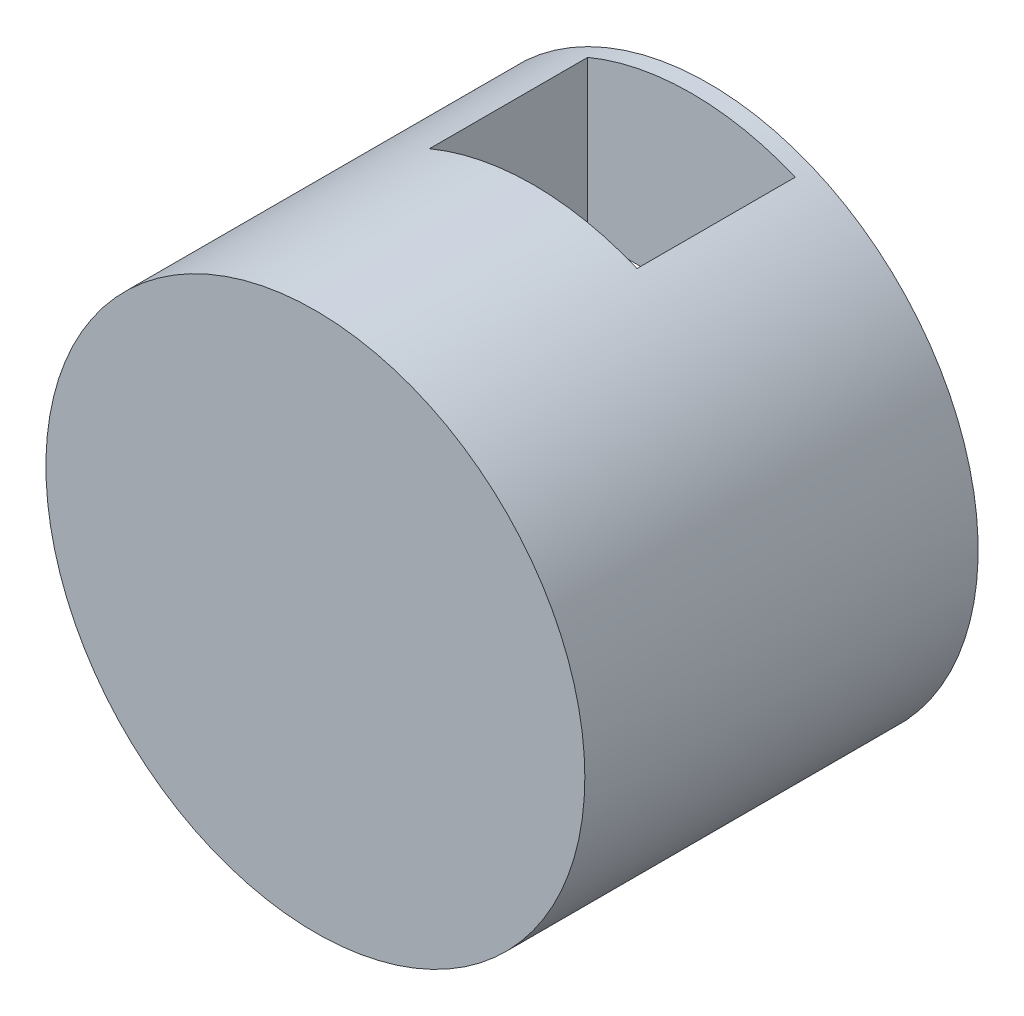
ISO-10303-21;
HEADER;
FILE_DESCRIPTION(('STEP AP214'),'2;1');
FILE_NAME('part.step','',(''),(''),'','','');
FILE_SCHEMA(('AUTOMOTIVE_DESIGN { 1 0 10303 214 1 1 1 1 }'));
ENDSEC;
DATA;
#1=APPLICATION_CONTEXT('core data for automotive mechanical design processes');
#2=APPLICATION_PROTOCOL_DEFINITION('international standard','automotive_design',2000,#1);
#3=PRODUCT_CONTEXT('',#1,'mechanical');
#4=PRODUCT('Part','Part','',(#3));
#5=PRODUCT_RELATED_PRODUCT_CATEGORY('part','',(#4));
#6=PRODUCT_DEFINITION_FORMATION('','',#4);
#7=PRODUCT_DEFINITION_CONTEXT('part definition',#1,'design');
#8=PRODUCT_DEFINITION('design','',#6,#7);
#9=PRODUCT_DEFINITION_SHAPE('','',#8);
#10=(LENGTH_UNIT() NAMED_UNIT(*) SI_UNIT(.MILLI.,.METRE.));
#11=(NAMED_UNIT(*) PLANE_ANGLE_UNIT() SI_UNIT($,.RADIAN.));
#12=(NAMED_UNIT(*) SI_UNIT($,.STERADIAN.) SOLID_ANGLE_UNIT());
#13=UNCERTAINTY_MEASURE_WITH_UNIT(LENGTH_MEASURE(1.E-05),#10,'distance_accuracy_value','');
#14=(GEOMETRIC_REPRESENTATION_CONTEXT(3) GLOBAL_UNCERTAINTY_ASSIGNED_CONTEXT((#13)) GLOBAL_UNIT_ASSIGNED_CONTEXT((#10,
#11,#12)) REPRESENTATION_CONTEXT('',''));
#15=CARTESIAN_POINT('',(0.,0.,0.));
#16=DIRECTION('',(0.,0.,1.));
#17=DIRECTION('',(1.,0.,0.));
#18=AXIS2_PLACEMENT_3D('',#15,#16,#17);
#19=CARTESIAN_POINT('',(0.,0.,32.8));
#20=DIRECTION('',(0.,0.,-1.));
#21=DIRECTION('',(-1.,0.,0.));
#22=AXIS2_PLACEMENT_3D('',#19,#20,#21);
#23=CYLINDRICAL_SURFACE('',#22,23.5);
#24=CARTESIAN_POINT('',(0.,0.,0.));
#25=DIRECTION('',(0.,0.,1.));
#26=DIRECTION('',(1.,0.,0.));
#27=AXIS2_PLACEMENT_3D('',#24,#25,#26);
#28=CIRCLE('',#27,23.5);
#29=CARTESIAN_POINT('',(9.05000000000001,21.6874963976942,0.));
#30=VERTEX_POINT('',#29);
#31=CARTESIAN_POINT('',(-9.05,21.6874963976942,0.));
#32=VERTEX_POINT('',#31);
#33=EDGE_CURVE('E104',#30,#32,#28,.T.);
#34=ORIENTED_EDGE('',*,*,#33,.F.);
#35=DIRECTION('',(0.,0.,-1.));
#36=VECTOR('',#35,1.);
#37=CARTESIAN_POINT('',(9.05,21.6874963976942,32.8));
#38=LINE('',#37,#36);
#39=CARTESIAN_POINT('',(9.05000000000001,21.6874963976942,13.8));
#40=VERTEX_POINT('',#39);
#41=EDGE_CURVE('E113',#30,#40,#38,.F.);
#42=ORIENTED_EDGE('',*,*,#41,.T.);
#43=CARTESIAN_POINT('',(0.,0.,13.8));
#44=DIRECTION('',(0.,0.,-1.));
#45=DIRECTION('',(-1.,0.,0.));
#46=AXIS2_PLACEMENT_3D('',#43,#44,#45);
#47=CIRCLE('',#46,23.5);
#48=CARTESIAN_POINT('',(-9.05,21.6874963976942,13.8));
#49=VERTEX_POINT('',#48);
#50=EDGE_CURVE('E11',#49,#40,#47,.T.);
#51=ORIENTED_EDGE('',*,*,#50,.F.);
#52=DIRECTION('',(0.,0.,-1.));
#53=VECTOR('',#52,1.);
#54=CARTESIAN_POINT('',(-9.05,21.6874963976942,32.8));
#55=LINE('',#54,#53);
#56=EDGE_CURVE('E116',#49,#32,#55,.T.);
#57=ORIENTED_EDGE('',*,*,#56,.T.);
#58=EDGE_LOOP('',(#34,#42,#51,#57));
#59=FACE_BOUND('',#58,.T.);
#60=CARTESIAN_POINT('',(0.,0.,32.8));
#61=DIRECTION('',(0.,0.,1.));
#62=DIRECTION('',(1.,0.,0.));
#63=AXIS2_PLACEMENT_3D('',#60,#61,#62);
#64=CIRCLE('',#63,23.5);
#65=CARTESIAN_POINT('',(23.5,0.,32.8));
#66=VERTEX_POINT('',#65);
#67=EDGE_CURVE('E106',#66,#66,#64,.T.);
#68=ORIENTED_EDGE('',*,*,#67,.F.);
#69=EDGE_LOOP('',(#68));
#70=FACE_BOUND('',#69,.T.);
#71=DIRECTION('',(0.,0.,-1.));
#72=VECTOR('',#71,1.);
#73=CARTESIAN_POINT('',(9.05,-21.6874963976942,32.8));
#74=LINE('',#73,#72);
#75=CARTESIAN_POINT('',(9.05,-21.6874963976942,13.8));
#76=VERTEX_POINT('',#75);
#77=CARTESIAN_POINT('',(9.05,-21.6874963976942,-1.5));
#78=VERTEX_POINT('',#77);
#79=EDGE_CURVE('E109',#76,#78,#74,.T.);
#80=ORIENTED_EDGE('',*,*,#79,.T.);
#81=CARTESIAN_POINT('',(0.,0.,-1.5));
#82=DIRECTION('',(0.,0.,1.));
#83=DIRECTION('',(1.,0.,0.));
#84=AXIS2_PLACEMENT_3D('',#81,#82,#83);
#85=CIRCLE('',#84,23.5);
#86=CARTESIAN_POINT('',(-9.05,-21.6874963976942,-1.5));
#87=VERTEX_POINT('',#86);
#88=EDGE_CURVE('E125',#78,#87,#85,.T.);
#89=ORIENTED_EDGE('',*,*,#88,.T.);
#90=DIRECTION('',(0.,0.,-1.));
#91=VECTOR('',#90,1.);
#92=CARTESIAN_POINT('',(-9.05,-21.6874963976942,32.8));
#93=LINE('',#92,#91);
#94=CARTESIAN_POINT('',(-9.05,-21.6874963976942,13.8));
#95=VERTEX_POINT('',#94);
#96=EDGE_CURVE('E47',#87,#95,#93,.F.);
#97=ORIENTED_EDGE('',*,*,#96,.T.);
#98=EDGE_CURVE('E36',#76,#95,#47,.T.);
#99=ORIENTED_EDGE('',*,*,#98,.F.);
#100=EDGE_LOOP('',(#80,#89,#97,#99));
#101=FACE_BOUND('',#100,.T.);
#102=ADVANCED_FACE('F33',(#59,#70,#101),#23,.T.);
#103=CARTESIAN_POINT('',(0.,0.,32.8));
#104=DIRECTION('',(0.,0.,1.));
#105=DIRECTION('',(1.,0.,0.));
#106=AXIS2_PLACEMENT_3D('',#103,#104,#105);
#107=PLANE('',#106);
#108=ORIENTED_EDGE('',*,*,#67,.T.);
#109=EDGE_LOOP('',(#108));
#110=FACE_BOUND('',#109,.T.);
#111=ADVANCED_FACE('F147',(#110),#107,.T.);
#112=CARTESIAN_POINT('',(0.,0.,13.8));
#113=DIRECTION('',(0.,0.,-1.));
#114=DIRECTION('',(-1.,0.,0.));
#115=AXIS2_PLACEMENT_3D('',#112,#113,#114);
#116=PLANE('',#115);
#117=DIRECTION('',(0.,1.,0.));
#118=VECTOR('',#117,1.);
#119=CARTESIAN_POINT('',(-9.05,23.5,13.8));
#120=LINE('',#119,#118);
#121=EDGE_CURVE('E119',#95,#49,#120,.T.);
#122=ORIENTED_EDGE('',*,*,#121,.T.);
#123=ORIENTED_EDGE('',*,*,#50,.T.);
#124=DIRECTION('',(0.,-1.,0.));
#125=VECTOR('',#124,1.);
#126=CARTESIAN_POINT('',(9.05000000000001,23.5,13.8));
#127=LINE('',#126,#125);
#128=EDGE_CURVE('E122',#40,#76,#127,.T.);
#129=ORIENTED_EDGE('',*,*,#128,.T.);
#130=ORIENTED_EDGE('',*,*,#98,.T.);
#131=EDGE_LOOP('',(#122,#123,#129,#130));
#132=FACE_BOUND('',#131,.T.);
#133=ADVANCED_FACE('F145',(#132),#116,.T.);
#134=CARTESIAN_POINT('',(9.05000000000001,23.5,13.8));
#135=DIRECTION('',(1.,0.,0.));
#136=DIRECTION('',(0.,1.,0.));
#137=AXIS2_PLACEMENT_3D('',#134,#135,#136);
#138=PLANE('',#137);
#139=ORIENTED_EDGE('',*,*,#128,.F.);
#140=ORIENTED_EDGE('',*,*,#41,.F.);
#141=DIRECTION('',(0.,1.,0.));
#142=VECTOR('',#141,1.);
#143=CARTESIAN_POINT('',(9.05,0.,0.));
#144=LINE('',#143,#142);
#145=CARTESIAN_POINT('',(9.05,8.2,0.));
#146=VERTEX_POINT('',#145);
#147=EDGE_CURVE('E105',#146,#30,#144,.T.);
#148=ORIENTED_EDGE('',*,*,#147,.F.);
#149=DIRECTION('',(0.,0.,-1.));
#150=VECTOR('',#149,1.);
#151=CARTESIAN_POINT('',(9.05,8.2,0.));
#152=LINE('',#151,#150);
#153=CARTESIAN_POINT('',(9.05,8.2,-1.5));
#154=VERTEX_POINT('',#153);
#155=EDGE_CURVE('E92',#146,#154,#152,.T.);
#156=ORIENTED_EDGE('',*,*,#155,.T.);
#157=DIRECTION('',(0.,-1.,0.));
#158=VECTOR('',#157,1.);
#159=CARTESIAN_POINT('',(9.05,8.2,-1.5));
#160=LINE('',#159,#158);
#161=EDGE_CURVE('E99',#154,#78,#160,.T.);
#162=ORIENTED_EDGE('',*,*,#161,.T.);
#163=ORIENTED_EDGE('',*,*,#79,.F.);
#164=EDGE_LOOP('',(#139,#140,#148,#156,#162,#163));
#165=FACE_BOUND('',#164,.T.);
#166=ADVANCED_FACE('F140',(#165),#138,.F.);
#167=CARTESIAN_POINT('',(-9.05,23.5,13.8));
#168=DIRECTION('',(-1.,0.,0.));
#169=DIRECTION('',(0.,-1.,0.));
#170=AXIS2_PLACEMENT_3D('',#167,#168,#169);
#171=PLANE('',#170);
#172=ORIENTED_EDGE('',*,*,#121,.F.);
#173=ORIENTED_EDGE('',*,*,#96,.F.);
#174=DIRECTION('',(0.,1.,0.));
#175=VECTOR('',#174,1.);
#176=CARTESIAN_POINT('',(-9.05,-21.6874963976942,-1.5));
#177=LINE('',#176,#175);
#178=CARTESIAN_POINT('',(-9.05000000000001,8.2,-1.5));
#179=VERTEX_POINT('',#178);
#180=EDGE_CURVE('E88',#87,#179,#177,.T.);
#181=ORIENTED_EDGE('',*,*,#180,.T.);
#182=DIRECTION('',(0.,0.,-1.));
#183=VECTOR('',#182,1.);
#184=CARTESIAN_POINT('',(-9.05000000000001,8.2,0.));
#185=LINE('',#184,#183);
#186=CARTESIAN_POINT('',(-9.05000000000001,8.2,0.));
#187=VERTEX_POINT('',#186);
#188=EDGE_CURVE('E81',#187,#179,#185,.T.);
#189=ORIENTED_EDGE('',*,*,#188,.F.);
#190=DIRECTION('',(0.,-1.,0.));
#191=VECTOR('',#190,1.);
#192=CARTESIAN_POINT('',(-9.05,0.,0.));
#193=LINE('',#192,#191);
#194=EDGE_CURVE('E86',#32,#187,#193,.T.);
#195=ORIENTED_EDGE('',*,*,#194,.F.);
#196=ORIENTED_EDGE('',*,*,#56,.F.);
#197=EDGE_LOOP('',(#172,#173,#181,#189,#195,#196));
#198=FACE_BOUND('',#197,.T.);
#199=ADVANCED_FACE('F83',(#198),#171,.F.);
#200=CARTESIAN_POINT('',(0.,0.,0.));
#201=DIRECTION('',(0.,0.,1.));
#202=DIRECTION('',(1.,0.,0.));
#203=AXIS2_PLACEMENT_3D('',#200,#201,#202);
#204=PLANE('',#203);
#205=DIRECTION('',(1.,0.,0.));
#206=VECTOR('',#205,1.);
#207=CARTESIAN_POINT('',(9.05,8.2,0.));
#208=LINE('',#207,#206);
#209=EDGE_CURVE('E93',#187,#146,#208,.T.);
#210=ORIENTED_EDGE('',*,*,#209,.T.);
#211=ORIENTED_EDGE('',*,*,#147,.T.);
#212=ORIENTED_EDGE('',*,*,#33,.T.);
#213=ORIENTED_EDGE('',*,*,#194,.T.);
#214=EDGE_LOOP('',(#210,#211,#212,#213));
#215=FACE_BOUND('',#214,.T.);
#216=ADVANCED_FACE('F102',(#215),#204,.T.);
#217=CARTESIAN_POINT('',(0.,0.,-1.5));
#218=DIRECTION('',(0.,0.,1.));
#219=DIRECTION('',(1.,0.,0.));
#220=AXIS2_PLACEMENT_3D('',#217,#218,#219);
#221=PLANE('',#220);
#222=ORIENTED_EDGE('',*,*,#88,.F.);
#223=ORIENTED_EDGE('',*,*,#161,.F.);
#224=DIRECTION('',(1.,0.,0.));
#225=VECTOR('',#224,1.);
#226=CARTESIAN_POINT('',(9.05,8.2,-1.5));
#227=LINE('',#226,#225);
#228=EDGE_CURVE('E132',#179,#154,#227,.T.);
#229=ORIENTED_EDGE('',*,*,#228,.F.);
#230=ORIENTED_EDGE('',*,*,#180,.F.);
#231=EDGE_LOOP('',(#222,#223,#229,#230));
#232=FACE_BOUND('',#231,.T.);
#233=ADVANCED_FACE('F137',(#232),#221,.F.);
#234=CARTESIAN_POINT('',(9.05,8.2,0.));
#235=DIRECTION('',(0.,1.,0.));
#236=DIRECTION('',(0.,0.,1.));
#237=AXIS2_PLACEMENT_3D('',#234,#235,#236);
#238=PLANE('',#237);
#239=ORIENTED_EDGE('',*,*,#228,.T.);
#240=ORIENTED_EDGE('',*,*,#155,.F.);
#241=ORIENTED_EDGE('',*,*,#209,.F.);
#242=ORIENTED_EDGE('',*,*,#188,.T.);
#243=EDGE_LOOP('',(#239,#240,#241,#242));
#244=FACE_BOUND('',#243,.T.);
#245=ADVANCED_FACE('F96',(#244),#238,.F.);
#246=CLOSED_SHELL('',(#102,#111,#133,#166,#199,#216,#233,#245));
#247=MANIFOLD_SOLID_BREP('B2',#246);
#248=ADVANCED_BREP_SHAPE_REPRESENTATION('',(#18,#247),#14);
#249=SHAPE_DEFINITION_REPRESENTATION(#9,#248);
ENDSEC;
END-ISO-10303-21;
